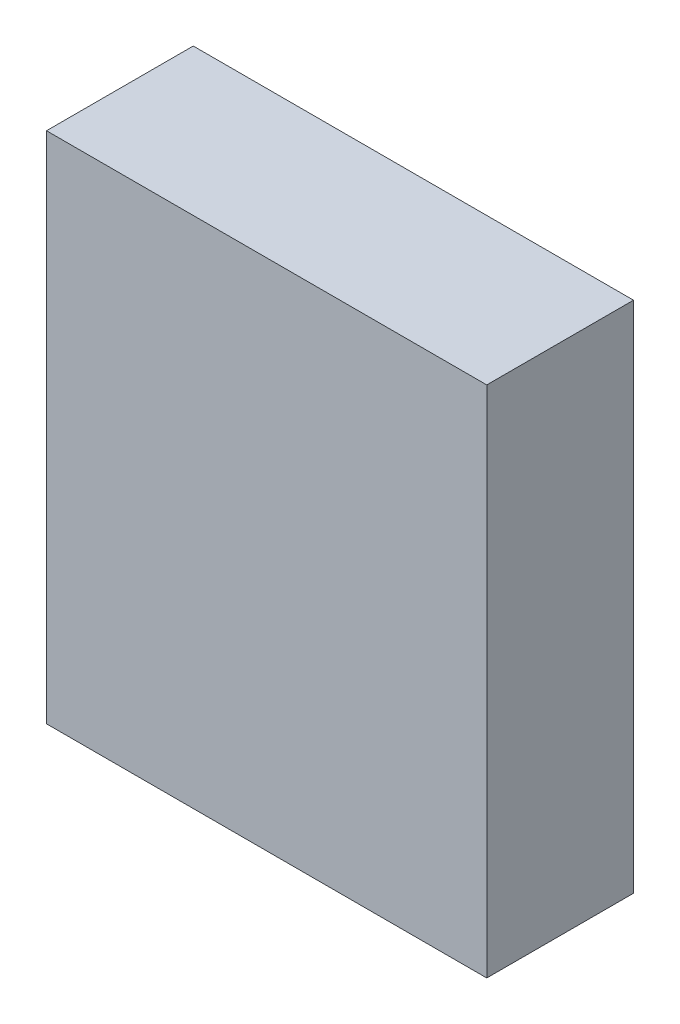
ISO-10303-21;
HEADER;
FILE_DESCRIPTION(('STEP AP214'),'2;1');
FILE_NAME('part.step','',(''),(''),'','','');
FILE_SCHEMA(('AUTOMOTIVE_DESIGN { 1 0 10303 214 1 1 1 1 }'));
ENDSEC;
DATA;
#1=APPLICATION_CONTEXT('core data for automotive mechanical design processes');
#2=APPLICATION_PROTOCOL_DEFINITION('international standard','automotive_design',2000,#1);
#3=PRODUCT_CONTEXT('',#1,'mechanical');
#4=PRODUCT('Part','Part','',(#3));
#5=PRODUCT_RELATED_PRODUCT_CATEGORY('part','',(#4));
#6=PRODUCT_DEFINITION_FORMATION('','',#4);
#7=PRODUCT_DEFINITION_CONTEXT('part definition',#1,'design');
#8=PRODUCT_DEFINITION('design','',#6,#7);
#9=PRODUCT_DEFINITION_SHAPE('','',#8);
#10=(LENGTH_UNIT() NAMED_UNIT(*) SI_UNIT(.MILLI.,.METRE.));
#11=(NAMED_UNIT(*) PLANE_ANGLE_UNIT() SI_UNIT($,.RADIAN.));
#12=(NAMED_UNIT(*) SI_UNIT($,.STERADIAN.) SOLID_ANGLE_UNIT());
#13=UNCERTAINTY_MEASURE_WITH_UNIT(LENGTH_MEASURE(1.E-05),#10,'distance_accuracy_value','');
#14=(GEOMETRIC_REPRESENTATION_CONTEXT(3) GLOBAL_UNCERTAINTY_ASSIGNED_CONTEXT((#13)) GLOBAL_UNIT_ASSIGNED_CONTEXT((#10,
#11,#12)) REPRESENTATION_CONTEXT('',''));
#15=CARTESIAN_POINT('',(0.,0.,0.));
#16=DIRECTION('',(0.,0.,1.));
#17=DIRECTION('',(1.,0.,0.));
#18=AXIS2_PLACEMENT_3D('',#15,#16,#17);
#19=CARTESIAN_POINT('',(-0.2999994,0.3499993,0.1999996));
#20=DIRECTION('',(0.,0.,1.));
#21=DIRECTION('',(1.,0.,0.));
#22=AXIS2_PLACEMENT_3D('',#19,#20,#21);
#23=PLANE('',#22);
#24=DIRECTION('',(0.,1.,0.));
#25=VECTOR('',#24,1.);
#26=CARTESIAN_POINT('',(-0.2999994,-0.3499993,0.1999996));
#27=LINE('',#26,#25);
#28=CARTESIAN_POINT('',(-0.2999994,-0.3499993,0.1999996));
#29=VERTEX_POINT('',#28);
#30=CARTESIAN_POINT('',(-0.2999994,0.3499993,0.1999996));
#31=VERTEX_POINT('',#30);
#32=EDGE_CURVE('E26',#29,#31,#27,.T.);
#33=ORIENTED_EDGE('',*,*,#32,.F.);
#34=DIRECTION('',(-1.,0.,0.));
#35=VECTOR('',#34,1.);
#36=CARTESIAN_POINT('',(0.2999994,-0.3499993,0.1999996));
#37=LINE('',#36,#35);
#38=CARTESIAN_POINT('',(0.2999994,-0.3499993,0.1999996));
#39=VERTEX_POINT('',#38);
#40=EDGE_CURVE('E61',#39,#29,#37,.T.);
#41=ORIENTED_EDGE('',*,*,#40,.F.);
#42=DIRECTION('',(0.,-1.,0.));
#43=VECTOR('',#42,1.);
#44=CARTESIAN_POINT('',(0.2999994,0.3499993,0.1999996));
#45=LINE('',#44,#43);
#46=CARTESIAN_POINT('',(0.2999994,0.3499993,0.1999996));
#47=VERTEX_POINT('',#46);
#48=EDGE_CURVE('E70',#47,#39,#45,.T.);
#49=ORIENTED_EDGE('',*,*,#48,.F.);
#50=DIRECTION('',(1.,0.,0.));
#51=VECTOR('',#50,1.);
#52=CARTESIAN_POINT('',(-0.2999994,0.3499993,0.1999996));
#53=LINE('',#52,#51);
#54=EDGE_CURVE('E94',#31,#47,#53,.T.);
#55=ORIENTED_EDGE('',*,*,#54,.F.);
#56=EDGE_LOOP('',(#33,#41,#49,#55));
#57=FACE_BOUND('',#56,.T.);
#58=ADVANCED_FACE('F17',(#57),#23,.T.);
#59=CARTESIAN_POINT('',(-0.2999994,0.3499993,0.));
#60=DIRECTION('',(0.,0.,1.));
#61=DIRECTION('',(1.,0.,0.));
#62=AXIS2_PLACEMENT_3D('',#59,#60,#61);
#63=PLANE('',#62);
#64=DIRECTION('',(1.,0.,0.));
#65=VECTOR('',#64,1.);
#66=CARTESIAN_POINT('',(-0.2999994,0.3499993,0.));
#67=LINE('',#66,#65);
#68=CARTESIAN_POINT('',(-0.2999994,0.3499993,0.));
#69=VERTEX_POINT('',#68);
#70=CARTESIAN_POINT('',(0.2999994,0.3499993,0.));
#71=VERTEX_POINT('',#70);
#72=EDGE_CURVE('E82',#69,#71,#67,.T.);
#73=ORIENTED_EDGE('',*,*,#72,.T.);
#74=DIRECTION('',(0.,-1.,0.));
#75=VECTOR('',#74,1.);
#76=CARTESIAN_POINT('',(0.2999994,0.3499993,0.));
#77=LINE('',#76,#75);
#78=CARTESIAN_POINT('',(0.2999994,-0.3499993,0.));
#79=VERTEX_POINT('',#78);
#80=EDGE_CURVE('E107',#71,#79,#77,.T.);
#81=ORIENTED_EDGE('',*,*,#80,.T.);
#82=DIRECTION('',(-1.,0.,0.));
#83=VECTOR('',#82,1.);
#84=CARTESIAN_POINT('',(0.2999994,-0.3499993,0.));
#85=LINE('',#84,#83);
#86=CARTESIAN_POINT('',(-0.2999994,-0.3499993,0.));
#87=VERTEX_POINT('',#86);
#88=EDGE_CURVE('E50',#79,#87,#85,.T.);
#89=ORIENTED_EDGE('',*,*,#88,.T.);
#90=DIRECTION('',(0.,1.,0.));
#91=VECTOR('',#90,1.);
#92=CARTESIAN_POINT('',(-0.2999994,-0.3499993,0.));
#93=LINE('',#92,#91);
#94=EDGE_CURVE('E11',#87,#69,#93,.T.);
#95=ORIENTED_EDGE('',*,*,#94,.T.);
#96=EDGE_LOOP('',(#73,#81,#89,#95));
#97=FACE_BOUND('',#96,.T.);
#98=ADVANCED_FACE('F81',(#97),#63,.F.);
#99=CARTESIAN_POINT('',(-0.2999994,-0.3499993,0.));
#100=DIRECTION('',(-1.,0.,0.));
#101=DIRECTION('',(0.,0.,1.));
#102=AXIS2_PLACEMENT_3D('',#99,#100,#101);
#103=PLANE('',#102);
#104=DIRECTION('',(0.,0.,1.));
#105=VECTOR('',#104,1.);
#106=CARTESIAN_POINT('',(-0.2999994,-0.3499993,0.));
#107=LINE('',#106,#105);
#108=EDGE_CURVE('E104',#87,#29,#107,.T.);
#109=ORIENTED_EDGE('',*,*,#108,.T.);
#110=ORIENTED_EDGE('',*,*,#32,.T.);
#111=DIRECTION('',(0.,0.,1.));
#112=VECTOR('',#111,1.);
#113=CARTESIAN_POINT('',(-0.2999994,0.3499993,0.));
#114=LINE('',#113,#112);
#115=EDGE_CURVE('E88',#69,#31,#114,.T.);
#116=ORIENTED_EDGE('',*,*,#115,.F.);
#117=ORIENTED_EDGE('',*,*,#94,.F.);
#118=EDGE_LOOP('',(#109,#110,#116,#117));
#119=FACE_BOUND('',#118,.T.);
#120=ADVANCED_FACE('F92',(#119),#103,.T.);
#121=CARTESIAN_POINT('',(0.2999994,-0.3499993,0.));
#122=DIRECTION('',(0.,-1.,0.));
#123=DIRECTION('',(0.,0.,-1.));
#124=AXIS2_PLACEMENT_3D('',#121,#122,#123);
#125=PLANE('',#124);
#126=DIRECTION('',(0.,0.,1.));
#127=VECTOR('',#126,1.);
#128=CARTESIAN_POINT('',(0.2999994,-0.3499993,0.));
#129=LINE('',#128,#127);
#130=EDGE_CURVE('E110',#79,#39,#129,.T.);
#131=ORIENTED_EDGE('',*,*,#130,.T.);
#132=ORIENTED_EDGE('',*,*,#40,.T.);
#133=ORIENTED_EDGE('',*,*,#108,.F.);
#134=ORIENTED_EDGE('',*,*,#88,.F.);
#135=EDGE_LOOP('',(#131,#132,#133,#134));
#136=FACE_BOUND('',#135,.T.);
#137=ADVANCED_FACE('F121',(#136),#125,.T.);
#138=CARTESIAN_POINT('',(0.2999994,0.3499993,0.));
#139=DIRECTION('',(1.,0.,0.));
#140=DIRECTION('',(0.,1.,0.));
#141=AXIS2_PLACEMENT_3D('',#138,#139,#140);
#142=PLANE('',#141);
#143=DIRECTION('',(0.,0.,1.));
#144=VECTOR('',#143,1.);
#145=CARTESIAN_POINT('',(0.2999994,0.3499993,0.));
#146=LINE('',#145,#144);
#147=EDGE_CURVE('E89',#71,#47,#146,.T.);
#148=ORIENTED_EDGE('',*,*,#147,.T.);
#149=ORIENTED_EDGE('',*,*,#48,.T.);
#150=ORIENTED_EDGE('',*,*,#130,.F.);
#151=ORIENTED_EDGE('',*,*,#80,.F.);
#152=EDGE_LOOP('',(#148,#149,#150,#151));
#153=FACE_BOUND('',#152,.T.);
#154=ADVANCED_FACE('F124',(#153),#142,.T.);
#155=CARTESIAN_POINT('',(-0.2999994,0.3499993,0.));
#156=DIRECTION('',(0.,1.,0.));
#157=DIRECTION('',(1.,0.,0.));
#158=AXIS2_PLACEMENT_3D('',#155,#156,#157);
#159=PLANE('',#158);
#160=ORIENTED_EDGE('',*,*,#115,.T.);
#161=ORIENTED_EDGE('',*,*,#54,.T.);
#162=ORIENTED_EDGE('',*,*,#147,.F.);
#163=ORIENTED_EDGE('',*,*,#72,.F.);
#164=EDGE_LOOP('',(#160,#161,#162,#163));
#165=FACE_BOUND('',#164,.T.);
#166=ADVANCED_FACE('F86',(#165),#159,.T.);
#167=CLOSED_SHELL('',(#58,#98,#120,#137,#154,#166));
#168=MANIFOLD_SOLID_BREP('B1',#167);
#169=ADVANCED_BREP_SHAPE_REPRESENTATION('',(#18,#168),#14);
#170=SHAPE_DEFINITION_REPRESENTATION(#9,#169);
ENDSEC;
END-ISO-10303-21;
